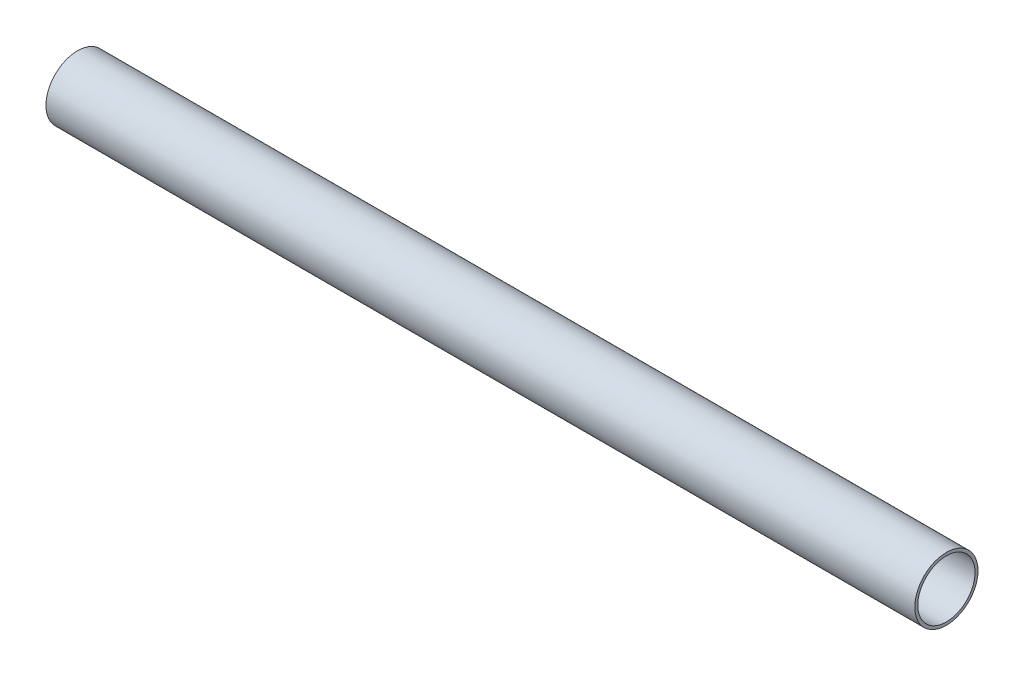
ISO-10303-21;
HEADER;
FILE_DESCRIPTION(('STEP AP214'),'2;1');
FILE_NAME('part.step','',(''),(''),'','','');
FILE_SCHEMA(('AUTOMOTIVE_DESIGN { 1 0 10303 214 1 1 1 1 }'));
ENDSEC;
DATA;
#1=APPLICATION_CONTEXT('core data for automotive mechanical design processes');
#2=APPLICATION_PROTOCOL_DEFINITION('international standard','automotive_design',2000,#1);
#3=PRODUCT_CONTEXT('',#1,'mechanical');
#4=PRODUCT('Part','Part','',(#3));
#5=PRODUCT_RELATED_PRODUCT_CATEGORY('part','',(#4));
#6=PRODUCT_DEFINITION_FORMATION('','',#4);
#7=PRODUCT_DEFINITION_CONTEXT('part definition',#1,'design');
#8=PRODUCT_DEFINITION('design','',#6,#7);
#9=PRODUCT_DEFINITION_SHAPE('','',#8);
#10=(LENGTH_UNIT() NAMED_UNIT(*) SI_UNIT(.MILLI.,.METRE.));
#11=(NAMED_UNIT(*) PLANE_ANGLE_UNIT() SI_UNIT($,.RADIAN.));
#12=(NAMED_UNIT(*) SI_UNIT($,.STERADIAN.) SOLID_ANGLE_UNIT());
#13=UNCERTAINTY_MEASURE_WITH_UNIT(LENGTH_MEASURE(1.E-05),#10,'distance_accuracy_value','');
#14=(GEOMETRIC_REPRESENTATION_CONTEXT(3) GLOBAL_UNCERTAINTY_ASSIGNED_CONTEXT((#13)) GLOBAL_UNIT_ASSIGNED_CONTEXT((#10,
#11,#12)) REPRESENTATION_CONTEXT('',''));
#15=CARTESIAN_POINT('',(0.,0.,0.));
#16=DIRECTION('',(0.,0.,1.));
#17=DIRECTION('',(1.,0.,0.));
#18=AXIS2_PLACEMENT_3D('',#15,#16,#17);
#19=CARTESIAN_POINT('',(0.,0.,0.));
#20=DIRECTION('',(1.,0.,0.));
#21=DIRECTION('',(0.,0.,-1.));
#22=AXIS2_PLACEMENT_3D('',#19,#20,#21);
#23=CYLINDRICAL_SURFACE('',#22,7.25);
#24=CARTESIAN_POINT('',(220.,0.,0.));
#25=DIRECTION('',(1.,0.,0.));
#26=DIRECTION('',(0.,0.,-1.));
#27=AXIS2_PLACEMENT_3D('',#24,#25,#26);
#28=CIRCLE('',#27,7.25);
#29=CARTESIAN_POINT('',(220.,0.,-7.25));
#30=VERTEX_POINT('',#29);
#31=EDGE_CURVE('E28',#30,#30,#28,.F.);
#32=ORIENTED_EDGE('',*,*,#31,.F.);
#33=EDGE_LOOP('',(#32));
#34=FACE_BOUND('',#33,.T.);
#35=CARTESIAN_POINT('',(0.,0.,0.));
#36=DIRECTION('',(1.,0.,0.));
#37=DIRECTION('',(0.,0.,-1.));
#38=AXIS2_PLACEMENT_3D('',#35,#36,#37);
#39=CIRCLE('',#38,7.25);
#40=CARTESIAN_POINT('',(0.,0.,-7.25));
#41=VERTEX_POINT('',#40);
#42=EDGE_CURVE('E19',#41,#41,#39,.F.);
#43=ORIENTED_EDGE('',*,*,#42,.T.);
#44=EDGE_LOOP('',(#43));
#45=FACE_BOUND('',#44,.T.);
#46=ADVANCED_FACE('F16',(#34,#45),#23,.F.);
#47=CARTESIAN_POINT('',(0.,0.,0.));
#48=DIRECTION('',(1.,0.,0.));
#49=DIRECTION('',(0.,0.,-1.));
#50=AXIS2_PLACEMENT_3D('',#47,#48,#49);
#51=PLANE('',#50);
#52=ORIENTED_EDGE('',*,*,#42,.F.);
#53=EDGE_LOOP('',(#52));
#54=FACE_BOUND('',#53,.T.);
#55=CARTESIAN_POINT('',(0.,0.,0.));
#56=DIRECTION('',(1.,0.,0.));
#57=DIRECTION('',(0.,0.,-1.));
#58=AXIS2_PLACEMENT_3D('',#55,#56,#57);
#59=CIRCLE('',#58,8.);
#60=CARTESIAN_POINT('',(0.,0.,-8.));
#61=VERTEX_POINT('',#60);
#62=EDGE_CURVE('E23',#61,#61,#59,.T.);
#63=ORIENTED_EDGE('',*,*,#62,.F.);
#64=EDGE_LOOP('',(#63));
#65=FACE_BOUND('',#64,.T.);
#66=ADVANCED_FACE('F37',(#54,#65),#51,.F.);
#67=CARTESIAN_POINT('',(220.,0.,0.));
#68=DIRECTION('',(1.,0.,0.));
#69=DIRECTION('',(0.,0.,-1.));
#70=AXIS2_PLACEMENT_3D('',#67,#68,#69);
#71=PLANE('',#70);
#72=ORIENTED_EDGE('',*,*,#31,.T.);
#73=EDGE_LOOP('',(#72));
#74=FACE_BOUND('',#73,.T.);
#75=CARTESIAN_POINT('',(220.,0.,0.));
#76=DIRECTION('',(1.,0.,0.));
#77=DIRECTION('',(0.,0.,-1.));
#78=AXIS2_PLACEMENT_3D('',#75,#76,#77);
#79=CIRCLE('',#78,8.);
#80=CARTESIAN_POINT('',(220.,0.,-8.));
#81=VERTEX_POINT('',#80);
#82=EDGE_CURVE('E10',#81,#81,#79,.F.);
#83=ORIENTED_EDGE('',*,*,#82,.F.);
#84=EDGE_LOOP('',(#83));
#85=FACE_BOUND('',#84,.T.);
#86=ADVANCED_FACE('F40',(#74,#85),#71,.T.);
#87=CARTESIAN_POINT('',(0.,0.,0.));
#88=DIRECTION('',(1.,0.,0.));
#89=DIRECTION('',(0.,0.,-1.));
#90=AXIS2_PLACEMENT_3D('',#87,#88,#89);
#91=CYLINDRICAL_SURFACE('',#90,8.);
#92=ORIENTED_EDGE('',*,*,#82,.T.);
#93=EDGE_LOOP('',(#92));
#94=FACE_BOUND('',#93,.T.);
#95=ORIENTED_EDGE('',*,*,#62,.T.);
#96=EDGE_LOOP('',(#95));
#97=FACE_BOUND('',#96,.T.);
#98=ADVANCED_FACE('F43',(#94,#97),#91,.T.);
#99=CLOSED_SHELL('',(#46,#66,#86,#98));
#100=MANIFOLD_SOLID_BREP('B1',#99);
#101=ADVANCED_BREP_SHAPE_REPRESENTATION('',(#18,#100),#14);
#102=SHAPE_DEFINITION_REPRESENTATION(#9,#101);
ENDSEC;
END-ISO-10303-21;
